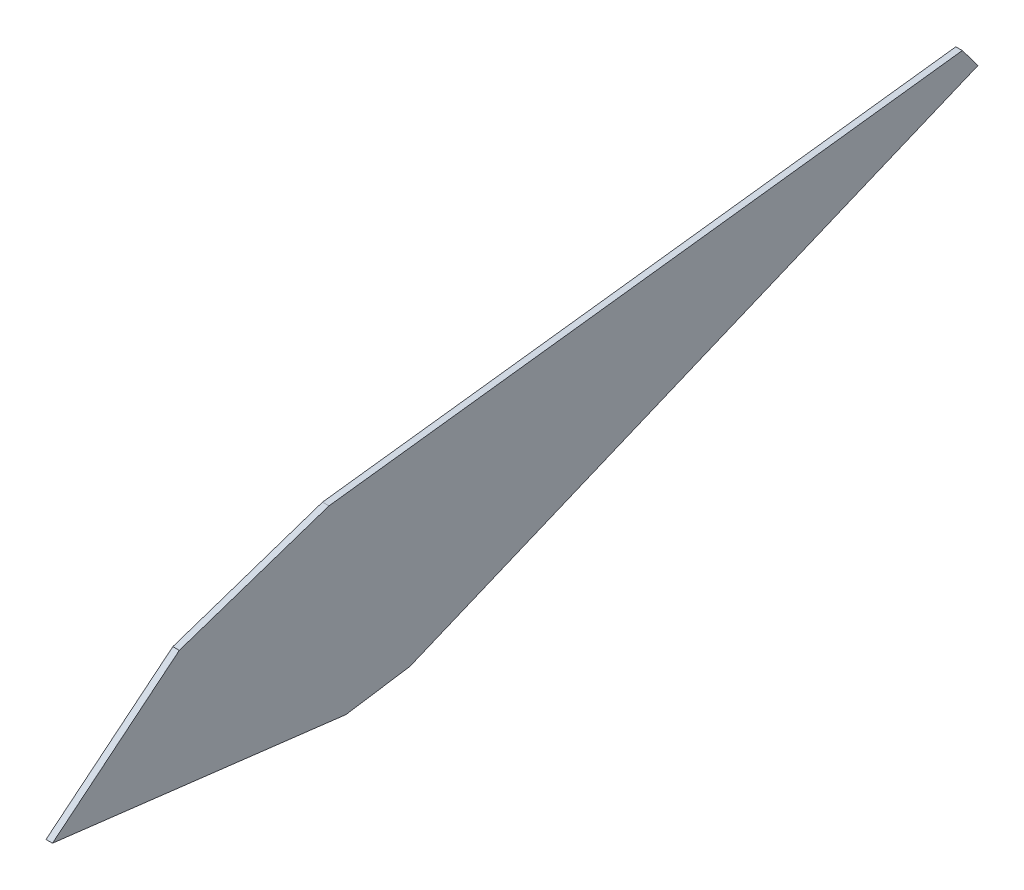
ISO-10303-21;
HEADER;
FILE_DESCRIPTION(('STEP AP214'),'2;1');
FILE_NAME('part.step','',(''),(''),'','','');
FILE_SCHEMA(('AUTOMOTIVE_DESIGN { 1 0 10303 214 1 1 1 1 }'));
ENDSEC;
DATA;
#1=APPLICATION_CONTEXT('core data for automotive mechanical design processes');
#2=APPLICATION_PROTOCOL_DEFINITION('international standard','automotive_design',2000,#1);
#3=PRODUCT_CONTEXT('',#1,'mechanical');
#4=PRODUCT('Part','Part','',(#3));
#5=PRODUCT_RELATED_PRODUCT_CATEGORY('part','',(#4));
#6=PRODUCT_DEFINITION_FORMATION('','',#4);
#7=PRODUCT_DEFINITION_CONTEXT('part definition',#1,'design');
#8=PRODUCT_DEFINITION('design','',#6,#7);
#9=PRODUCT_DEFINITION_SHAPE('','',#8);
#10=(LENGTH_UNIT() NAMED_UNIT(*) SI_UNIT(.MILLI.,.METRE.));
#11=(NAMED_UNIT(*) PLANE_ANGLE_UNIT() SI_UNIT($,.RADIAN.));
#12=(NAMED_UNIT(*) SI_UNIT($,.STERADIAN.) SOLID_ANGLE_UNIT());
#13=UNCERTAINTY_MEASURE_WITH_UNIT(LENGTH_MEASURE(1.E-05),#10,'distance_accuracy_value','');
#14=(GEOMETRIC_REPRESENTATION_CONTEXT(3) GLOBAL_UNCERTAINTY_ASSIGNED_CONTEXT((#13)) GLOBAL_UNIT_ASSIGNED_CONTEXT((#10,
#11,#12)) REPRESENTATION_CONTEXT('',''));
#15=CARTESIAN_POINT('',(0.,0.,0.));
#16=DIRECTION('',(0.,0.,1.));
#17=DIRECTION('',(1.,0.,0.));
#18=AXIS2_PLACEMENT_3D('',#15,#16,#17);
#19=CARTESIAN_POINT('',(0.635,-17.46504,30.30982));
#20=DIRECTION('',(0.,0.923267357697167,0.384158022447652));
#21=DIRECTION('',(0.,-0.384158022447652,0.923267357697168));
#22=AXIS2_PLACEMENT_3D('',#19,#20,#21);
#23=PLANE('',#22);
#24=DIRECTION('',(0.,0.384158022447652,-0.923267357697168));
#25=VECTOR('',#24,1.);
#26=CARTESIAN_POINT('',(0.,-17.46504,30.30982));
#27=LINE('',#26,#25);
#28=CARTESIAN_POINT('',(0.,-17.46504,30.30982));
#29=VERTEX_POINT('',#28);
#30=CARTESIAN_POINT('',(0.,5.715,-25.4));
#31=VERTEX_POINT('',#30);
#32=EDGE_CURVE('E125',#29,#31,#27,.T.);
#33=ORIENTED_EDGE('',*,*,#32,.T.);
#34=DIRECTION('',(-1.,0.,0.));
#35=VECTOR('',#34,1.);
#36=CARTESIAN_POINT('',(0.635,5.715,-25.4));
#37=LINE('',#36,#35);
#38=CARTESIAN_POINT('',(0.635,5.715,-25.4));
#39=VERTEX_POINT('',#38);
#40=EDGE_CURVE('E11',#39,#31,#37,.T.);
#41=ORIENTED_EDGE('',*,*,#40,.F.);
#42=DIRECTION('',(0.,0.384158022447652,-0.923267357697168));
#43=VECTOR('',#42,1.);
#44=CARTESIAN_POINT('',(0.635,-17.46504,30.30982));
#45=LINE('',#44,#43);
#46=CARTESIAN_POINT('',(0.635,-17.46504,30.30982));
#47=VERTEX_POINT('',#46);
#48=EDGE_CURVE('E137',#47,#39,#45,.T.);
#49=ORIENTED_EDGE('',*,*,#48,.F.);
#50=DIRECTION('',(-1.,0.,0.));
#51=VECTOR('',#50,1.);
#52=CARTESIAN_POINT('',(0.635,-17.46504,30.30982));
#53=LINE('',#52,#51);
#54=EDGE_CURVE('E121',#47,#29,#53,.T.);
#55=ORIENTED_EDGE('',*,*,#54,.T.);
#56=EDGE_LOOP('',(#33,#41,#49,#55));
#57=FACE_BOUND('',#56,.T.);
#58=ADVANCED_FACE('F35',(#57),#23,.F.);
#59=CARTESIAN_POINT('',(0.635,5.715,-25.4));
#60=DIRECTION('',(0.,-0.601905322033391,0.798567456955191));
#61=DIRECTION('',(0.,-0.798567456955191,-0.601905322033391));
#62=AXIS2_PLACEMENT_3D('',#59,#60,#61);
#63=PLANE('',#62);
#64=DIRECTION('',(0.,0.798567456955191,0.601905322033391));
#65=VECTOR('',#64,1.);
#66=CARTESIAN_POINT('',(0.,5.715,-25.4));
#67=LINE('',#66,#65);
#68=CARTESIAN_POINT('',(0.,7.75716,-23.86076));
#69=VERTEX_POINT('',#68);
#70=EDGE_CURVE('E128',#31,#69,#67,.T.);
#71=ORIENTED_EDGE('',*,*,#70,.T.);
#72=DIRECTION('',(-1.,0.,0.));
#73=VECTOR('',#72,1.);
#74=CARTESIAN_POINT('',(0.635,7.75716,-23.86076));
#75=LINE('',#74,#73);
#76=CARTESIAN_POINT('',(0.635,7.75716,-23.86076));
#77=VERTEX_POINT('',#76);
#78=EDGE_CURVE('E43',#77,#69,#75,.T.);
#79=ORIENTED_EDGE('',*,*,#78,.F.);
#80=DIRECTION('',(0.,0.798567456955191,0.601905322033391));
#81=VECTOR('',#80,1.);
#82=CARTESIAN_POINT('',(0.635,5.715,-25.4));
#83=LINE('',#82,#81);
#84=EDGE_CURVE('E91',#39,#77,#83,.T.);
#85=ORIENTED_EDGE('',*,*,#84,.F.);
#86=ORIENTED_EDGE('',*,*,#40,.T.);
#87=EDGE_LOOP('',(#71,#79,#85,#86));
#88=FACE_BOUND('',#87,.T.);
#89=ADVANCED_FACE('F162',(#88),#63,.F.);
#90=CARTESIAN_POINT('',(0.635,7.75716,-23.86076));
#91=DIRECTION('',(0.,-0.992563085406152,-0.121731349655791));
#92=DIRECTION('',(0.,0.121731349655791,-0.992563085406152));
#93=AXIS2_PLACEMENT_3D('',#90,#91,#92);
#94=PLANE('',#93);
#95=DIRECTION('',(0.,-0.121731349655791,0.992563085406152));
#96=VECTOR('',#95,1.);
#97=CARTESIAN_POINT('',(0.,7.75716,-23.86076));
#98=LINE('',#97,#96);
#99=CARTESIAN_POINT('',(0.,0.1397,38.24986));
#100=VERTEX_POINT('',#99);
#101=EDGE_CURVE('E130',#69,#100,#98,.T.);
#102=ORIENTED_EDGE('',*,*,#101,.T.);
#103=DIRECTION('',(-1.,0.,0.));
#104=VECTOR('',#103,1.);
#105=CARTESIAN_POINT('',(0.635,0.1397,38.24986));
#106=LINE('',#105,#104);
#107=CARTESIAN_POINT('',(0.635,0.1397,38.24986));
#108=VERTEX_POINT('',#107);
#109=EDGE_CURVE('E141',#108,#100,#106,.T.);
#110=ORIENTED_EDGE('',*,*,#109,.F.);
#111=DIRECTION('',(0.,-0.121731349655791,0.992563085406152));
#112=VECTOR('',#111,1.);
#113=CARTESIAN_POINT('',(0.635,7.75716,-23.86076));
#114=LINE('',#113,#112);
#115=EDGE_CURVE('E149',#77,#108,#114,.T.);
#116=ORIENTED_EDGE('',*,*,#115,.F.);
#117=ORIENTED_EDGE('',*,*,#78,.T.);
#118=EDGE_LOOP('',(#102,#110,#116,#117));
#119=FACE_BOUND('',#118,.T.);
#120=ADVANCED_FACE('F147',(#119),#94,.F.);
#121=CARTESIAN_POINT('',(0.635,0.1397,38.24986));
#122=DIRECTION('',(0.,-0.947876671886927,-0.318637434857491));
#123=DIRECTION('',(0.,0.318637434857491,-0.947876671886927));
#124=AXIS2_PLACEMENT_3D('',#121,#122,#123);
#125=PLANE('',#124);
#126=DIRECTION('',(0.,-0.318637434857491,0.947876671886928));
#127=VECTOR('',#126,1.);
#128=CARTESIAN_POINT('',(0.,0.1397,38.24986));
#129=LINE('',#128,#127);
#130=CARTESIAN_POINT('',(0.,-4.79552,52.93106));
#131=VERTEX_POINT('',#130);
#132=EDGE_CURVE('E132',#100,#131,#129,.T.);
#133=ORIENTED_EDGE('',*,*,#132,.T.);
#134=DIRECTION('',(-1.,0.,0.));
#135=VECTOR('',#134,1.);
#136=CARTESIAN_POINT('',(0.635,-4.79552,52.93106));
#137=LINE('',#136,#135);
#138=CARTESIAN_POINT('',(0.635,-4.79552,52.93106));
#139=VERTEX_POINT('',#138);
#140=EDGE_CURVE('E116',#139,#131,#137,.T.);
#141=ORIENTED_EDGE('',*,*,#140,.F.);
#142=DIRECTION('',(0.,-0.318637434857491,0.947876671886928));
#143=VECTOR('',#142,1.);
#144=CARTESIAN_POINT('',(0.635,0.1397,38.24986));
#145=LINE('',#144,#143);
#146=EDGE_CURVE('E107',#108,#139,#145,.T.);
#147=ORIENTED_EDGE('',*,*,#146,.F.);
#148=ORIENTED_EDGE('',*,*,#109,.T.);
#149=EDGE_LOOP('',(#133,#141,#147,#148));
#150=FACE_BOUND('',#149,.T.);
#151=ADVANCED_FACE('F155',(#150),#125,.F.);
#152=CARTESIAN_POINT('',(0.635,-4.79552,52.93106));
#153=DIRECTION('',(0.,-0.77447143004225,-0.632608887108229));
#154=DIRECTION('',(0.,0.632608887108229,-0.77447143004225));
#155=AXIS2_PLACEMENT_3D('',#152,#153,#154);
#156=PLANE('',#155);
#157=DIRECTION('',(0.,-0.632608887108229,0.77447143004225));
#158=VECTOR('',#157,1.);
#159=CARTESIAN_POINT('',(0.,-4.79552,52.93106));
#160=LINE('',#159,#158);
#161=CARTESIAN_POINT('',(0.,-14.95552,65.36944));
#162=VERTEX_POINT('',#161);
#163=EDGE_CURVE('E115',#131,#162,#160,.T.);
#164=ORIENTED_EDGE('',*,*,#163,.T.);
#165=DIRECTION('',(-1.,0.,0.));
#166=VECTOR('',#165,1.);
#167=CARTESIAN_POINT('',(0.635,-14.95552,65.36944));
#168=LINE('',#167,#166);
#169=CARTESIAN_POINT('',(0.635,-14.95552,65.36944));
#170=VERTEX_POINT('',#169);
#171=EDGE_CURVE('E112',#170,#162,#168,.T.);
#172=ORIENTED_EDGE('',*,*,#171,.F.);
#173=DIRECTION('',(0.,-0.632608887108229,0.77447143004225));
#174=VECTOR('',#173,1.);
#175=CARTESIAN_POINT('',(0.635,-4.79552,52.93106));
#176=LINE('',#175,#174);
#177=EDGE_CURVE('E101',#139,#170,#176,.T.);
#178=ORIENTED_EDGE('',*,*,#177,.F.);
#179=ORIENTED_EDGE('',*,*,#140,.T.);
#180=EDGE_LOOP('',(#164,#172,#178,#179));
#181=FACE_BOUND('',#180,.T.);
#182=ADVANCED_FACE('F113',(#181),#156,.F.);
#183=CARTESIAN_POINT('',(0.635,-14.95552,65.36944));
#184=DIRECTION('',(0.,0.992823258998328,-0.11959087085534));
#185=DIRECTION('',(0.,0.11959087085534,0.992823258998328));
#186=AXIS2_PLACEMENT_3D('',#183,#184,#185);
#187=PLANE('',#186);
#188=DIRECTION('',(0.,-0.11959087085534,-0.992823258998328));
#189=VECTOR('',#188,1.);
#190=CARTESIAN_POINT('',(0.,-14.95552,65.36944));
#191=LINE('',#190,#189);
#192=CARTESIAN_POINT('',(0.,-18.42262,36.58616));
#193=VERTEX_POINT('',#192);
#194=EDGE_CURVE('E77',#162,#193,#191,.T.);
#195=ORIENTED_EDGE('',*,*,#194,.T.);
#196=DIRECTION('',(-1.,0.,0.));
#197=VECTOR('',#196,1.);
#198=CARTESIAN_POINT('',(0.635,-18.42262,36.58616));
#199=LINE('',#198,#197);
#200=CARTESIAN_POINT('',(0.635,-18.42262,36.58616));
#201=VERTEX_POINT('',#200);
#202=EDGE_CURVE('E117',#201,#193,#199,.T.);
#203=ORIENTED_EDGE('',*,*,#202,.F.);
#204=DIRECTION('',(0.,-0.11959087085534,-0.992823258998328));
#205=VECTOR('',#204,1.);
#206=CARTESIAN_POINT('',(0.635,-14.95552,65.36944));
#207=LINE('',#206,#205);
#208=EDGE_CURVE('E105',#170,#201,#207,.T.);
#209=ORIENTED_EDGE('',*,*,#208,.F.);
#210=ORIENTED_EDGE('',*,*,#171,.T.);
#211=EDGE_LOOP('',(#195,#203,#209,#210));
#212=FACE_BOUND('',#211,.T.);
#213=ADVANCED_FACE('F119',(#212),#187,.F.);
#214=CARTESIAN_POINT('',(0.635,-18.42262,36.58616));
#215=DIRECTION('',(0.,0.988560555272323,0.15082449588736));
#216=DIRECTION('',(0.,-0.15082449588736,0.988560555272323));
#217=AXIS2_PLACEMENT_3D('',#214,#215,#216);
#218=PLANE('',#217);
#219=DIRECTION('',(0.,0.15082449588736,-0.988560555272323));
#220=VECTOR('',#219,1.);
#221=CARTESIAN_POINT('',(0.,-18.42262,36.58616));
#222=LINE('',#221,#220);
#223=EDGE_CURVE('E83',#193,#29,#222,.T.);
#224=ORIENTED_EDGE('',*,*,#223,.T.);
#225=ORIENTED_EDGE('',*,*,#54,.F.);
#226=DIRECTION('',(0.,0.15082449588736,-0.988560555272323));
#227=VECTOR('',#226,1.);
#228=CARTESIAN_POINT('',(0.635,-18.42262,36.58616));
#229=LINE('',#228,#227);
#230=EDGE_CURVE('E51',#201,#47,#229,.T.);
#231=ORIENTED_EDGE('',*,*,#230,.F.);
#232=ORIENTED_EDGE('',*,*,#202,.T.);
#233=EDGE_LOOP('',(#224,#225,#231,#232));
#234=FACE_BOUND('',#233,.T.);
#235=ADVANCED_FACE('F176',(#234),#218,.F.);
#236=CARTESIAN_POINT('',(0.635,0.,0.));
#237=DIRECTION('',(1.,0.,0.));
#238=DIRECTION('',(0.,0.,-1.));
#239=AXIS2_PLACEMENT_3D('',#236,#237,#238);
#240=PLANE('',#239);
#241=ORIENTED_EDGE('',*,*,#48,.T.);
#242=ORIENTED_EDGE('',*,*,#84,.T.);
#243=ORIENTED_EDGE('',*,*,#115,.T.);
#244=ORIENTED_EDGE('',*,*,#146,.T.);
#245=ORIENTED_EDGE('',*,*,#177,.T.);
#246=ORIENTED_EDGE('',*,*,#208,.T.);
#247=ORIENTED_EDGE('',*,*,#230,.T.);
#248=EDGE_LOOP('',(#241,#242,#243,#244,#245,#246,#247));
#249=FACE_BOUND('',#248,.T.);
#250=ADVANCED_FACE('F103',(#249),#240,.T.);
#251=CARTESIAN_POINT('',(0.,0.,0.));
#252=DIRECTION('',(1.,0.,0.));
#253=DIRECTION('',(0.,0.,-1.));
#254=AXIS2_PLACEMENT_3D('',#251,#252,#253);
#255=PLANE('',#254);
#256=ORIENTED_EDGE('',*,*,#32,.F.);
#257=ORIENTED_EDGE('',*,*,#223,.F.);
#258=ORIENTED_EDGE('',*,*,#194,.F.);
#259=ORIENTED_EDGE('',*,*,#163,.F.);
#260=ORIENTED_EDGE('',*,*,#132,.F.);
#261=ORIENTED_EDGE('',*,*,#101,.F.);
#262=ORIENTED_EDGE('',*,*,#70,.F.);
#263=EDGE_LOOP('',(#256,#257,#258,#259,#260,#261,#262));
#264=FACE_BOUND('',#263,.T.);
#265=ADVANCED_FACE('F153',(#264),#255,.F.);
#266=CLOSED_SHELL('',(#58,#89,#120,#151,#182,#213,#235,#250,#265));
#267=MANIFOLD_SOLID_BREP('B2',#266);
#268=ADVANCED_BREP_SHAPE_REPRESENTATION('',(#18,#267),#14);
#269=SHAPE_DEFINITION_REPRESENTATION(#9,#268);
ENDSEC;
END-ISO-10303-21;
